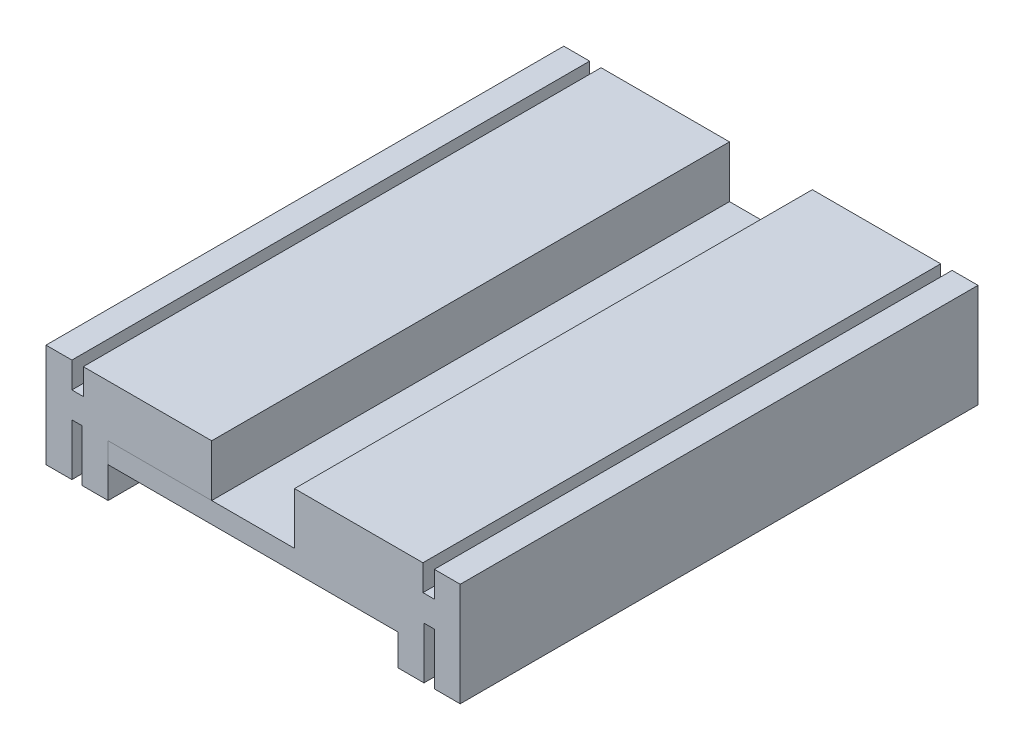
ISO-10303-21;
HEADER;
FILE_DESCRIPTION(('STEP AP214'),'2;1');
FILE_NAME('part.step','',(''),(''),'','','');
FILE_SCHEMA(('AUTOMOTIVE_DESIGN { 1 0 10303 214 1 1 1 1 }'));
ENDSEC;
DATA;
#1=APPLICATION_CONTEXT('core data for automotive mechanical design processes');
#2=APPLICATION_PROTOCOL_DEFINITION('international standard','automotive_design',2000,#1);
#3=PRODUCT_CONTEXT('',#1,'mechanical');
#4=PRODUCT('Part','Part','',(#3));
#5=PRODUCT_RELATED_PRODUCT_CATEGORY('part','',(#4));
#6=PRODUCT_DEFINITION_FORMATION('','',#4);
#7=PRODUCT_DEFINITION_CONTEXT('part definition',#1,'design');
#8=PRODUCT_DEFINITION('design','',#6,#7);
#9=PRODUCT_DEFINITION_SHAPE('','',#8);
#10=(LENGTH_UNIT() NAMED_UNIT(*) SI_UNIT(.MILLI.,.METRE.));
#11=(NAMED_UNIT(*) PLANE_ANGLE_UNIT() SI_UNIT($,.RADIAN.));
#12=(NAMED_UNIT(*) SI_UNIT($,.STERADIAN.) SOLID_ANGLE_UNIT());
#13=UNCERTAINTY_MEASURE_WITH_UNIT(LENGTH_MEASURE(1.E-05),#10,'distance_accuracy_value','');
#14=(GEOMETRIC_REPRESENTATION_CONTEXT(3) GLOBAL_UNCERTAINTY_ASSIGNED_CONTEXT((#13)) GLOBAL_UNIT_ASSIGNED_CONTEXT((#10,
#11,#12)) REPRESENTATION_CONTEXT('',''));
#15=CARTESIAN_POINT('',(0.,0.,0.));
#16=DIRECTION('',(0.,0.,1.));
#17=DIRECTION('',(1.,0.,0.));
#18=AXIS2_PLACEMENT_3D('',#15,#16,#17);
#19=CARTESIAN_POINT('',(28.,-20.,0.));
#20=DIRECTION('',(1.,0.,0.));
#21=DIRECTION('',(0.,0.,-1.));
#22=AXIS2_PLACEMENT_3D('',#19,#20,#21);
#23=PLANE('',#22);
#24=DIRECTION('',(0.,0.,1.));
#25=VECTOR('',#24,1.);
#26=CARTESIAN_POINT('',(28.,-14.,100.));
#27=LINE('',#26,#25);
#28=CARTESIAN_POINT('',(28.,-14.,0.));
#29=VERTEX_POINT('',#28);
#30=CARTESIAN_POINT('',(28.,-14.,100.));
#31=VERTEX_POINT('',#30);
#32=EDGE_CURVE('E64',#29,#31,#27,.T.);
#33=ORIENTED_EDGE('',*,*,#32,.F.);
#34=DIRECTION('',(0.,1.,0.));
#35=VECTOR('',#34,1.);
#36=CARTESIAN_POINT('',(28.,-20.,0.));
#37=LINE('',#36,#35);
#38=CARTESIAN_POINT('',(28.,-20.,0.));
#39=VERTEX_POINT('',#38);
#40=EDGE_CURVE('E164',#39,#29,#37,.T.);
#41=ORIENTED_EDGE('',*,*,#40,.F.);
#42=DIRECTION('',(0.,0.,-1.));
#43=VECTOR('',#42,1.);
#44=CARTESIAN_POINT('',(28.,-20.,0.));
#45=LINE('',#44,#43);
#46=CARTESIAN_POINT('',(28.,-20.,100.));
#47=VERTEX_POINT('',#46);
#48=EDGE_CURVE('E264',#47,#39,#45,.T.);
#49=ORIENTED_EDGE('',*,*,#48,.F.);
#50=DIRECTION('',(0.,1.,0.));
#51=VECTOR('',#50,1.);
#52=CARTESIAN_POINT('',(28.,-20.,100.));
#53=LINE('',#52,#51);
#54=EDGE_CURVE('E60',#47,#31,#53,.T.);
#55=ORIENTED_EDGE('',*,*,#54,.T.);
#56=EDGE_LOOP('',(#33,#41,#49,#55));
#57=FACE_BOUND('',#56,.T.);
#58=ADVANCED_FACE('F43',(#57),#23,.F.);
#59=CARTESIAN_POINT('',(-40.,0.,100.));
#60=DIRECTION('',(0.,1.,0.));
#61=DIRECTION('',(0.,0.,1.));
#62=AXIS2_PLACEMENT_3D('',#59,#60,#61);
#63=PLANE('',#62);
#64=DIRECTION('',(0.,0.,-1.));
#65=VECTOR('',#64,1.);
#66=CARTESIAN_POINT('',(8.,0.,100.));
#67=LINE('',#66,#65);
#68=CARTESIAN_POINT('',(8.,0.,100.));
#69=VERTEX_POINT('',#68);
#70=CARTESIAN_POINT('',(8.,0.,0.));
#71=VERTEX_POINT('',#70);
#72=EDGE_CURVE('E52',#69,#71,#67,.T.);
#73=ORIENTED_EDGE('',*,*,#72,.F.);
#74=DIRECTION('',(1.,0.,0.));
#75=VECTOR('',#74,1.);
#76=CARTESIAN_POINT('',(10.,0.,100.));
#77=LINE('',#76,#75);
#78=CARTESIAN_POINT('',(32.8,0.,100.));
#79=VERTEX_POINT('',#78);
#80=EDGE_CURVE('E184',#69,#79,#77,.T.);
#81=ORIENTED_EDGE('',*,*,#80,.T.);
#82=DIRECTION('',(0.,0.,1.));
#83=VECTOR('',#82,1.);
#84=CARTESIAN_POINT('',(32.8,0.,100.));
#85=LINE('',#84,#83);
#86=CARTESIAN_POINT('',(32.8,0.,0.));
#87=VERTEX_POINT('',#86);
#88=EDGE_CURVE('E207',#87,#79,#85,.T.);
#89=ORIENTED_EDGE('',*,*,#88,.F.);
#90=DIRECTION('',(1.,0.,0.));
#91=VECTOR('',#90,1.);
#92=CARTESIAN_POINT('',(-40.,0.,0.));
#93=LINE('',#92,#91);
#94=EDGE_CURVE('E47',#71,#87,#93,.T.);
#95=ORIENTED_EDGE('',*,*,#94,.F.);
#96=EDGE_LOOP('',(#73,#81,#89,#95));
#97=FACE_BOUND('',#96,.T.);
#98=ADVANCED_FACE('F304',(#97),#63,.T.);
#99=CARTESIAN_POINT('',(0.,0.,100.));
#100=DIRECTION('',(0.,0.,-1.));
#101=DIRECTION('',(-1.,0.,0.));
#102=AXIS2_PLACEMENT_3D('',#99,#100,#101);
#103=PLANE('',#102);
#104=ORIENTED_EDGE('',*,*,#80,.F.);
#105=DIRECTION('',(0.,1.,0.));
#106=VECTOR('',#105,1.);
#107=CARTESIAN_POINT('',(8.,-11.,100.));
#108=LINE('',#107,#106);
#109=CARTESIAN_POINT('',(8.,-10.,100.));
#110=VERTEX_POINT('',#109);
#111=EDGE_CURVE('E261',#110,#69,#108,.T.);
#112=ORIENTED_EDGE('',*,*,#111,.F.);
#113=DIRECTION('',(-1.,0.,0.));
#114=VECTOR('',#113,1.);
#115=CARTESIAN_POINT('',(-28.,-10.,100.));
#116=LINE('',#115,#114);
#117=CARTESIAN_POINT('',(-28.,-10.,100.));
#118=VERTEX_POINT('',#117);
#119=EDGE_CURVE('E175',#110,#118,#116,.T.);
#120=ORIENTED_EDGE('',*,*,#119,.T.);
#121=DIRECTION('',(0.,1.,0.));
#122=VECTOR('',#121,1.);
#123=CARTESIAN_POINT('',(-28.,-14.,100.));
#124=LINE('',#123,#122);
#125=CARTESIAN_POINT('',(-28.,-14.,100.));
#126=VERTEX_POINT('',#125);
#127=EDGE_CURVE('E181',#126,#118,#124,.T.);
#128=ORIENTED_EDGE('',*,*,#127,.F.);
#129=DIRECTION('',(-1.,0.,0.));
#130=VECTOR('',#129,1.);
#131=CARTESIAN_POINT('',(-28.,-14.,100.));
#132=LINE('',#131,#130);
#133=EDGE_CURVE('E171',#31,#126,#132,.T.);
#134=ORIENTED_EDGE('',*,*,#133,.F.);
#135=ORIENTED_EDGE('',*,*,#54,.F.);
#136=DIRECTION('',(-1.,0.,0.));
#137=VECTOR('',#136,1.);
#138=CARTESIAN_POINT('',(28.,-20.,100.));
#139=LINE('',#138,#137);
#140=CARTESIAN_POINT('',(33.,-20.,100.));
#141=VERTEX_POINT('',#140);
#142=EDGE_CURVE('E253',#141,#47,#139,.T.);
#143=ORIENTED_EDGE('',*,*,#142,.F.);
#144=DIRECTION('',(0.,1.,0.));
#145=VECTOR('',#144,1.);
#146=CARTESIAN_POINT('',(33.,-20.,100.));
#147=LINE('',#146,#145);
#148=CARTESIAN_POINT('',(33.,-10.,100.));
#149=VERTEX_POINT('',#148);
#150=EDGE_CURVE('E254',#141,#149,#147,.T.);
#151=ORIENTED_EDGE('',*,*,#150,.T.);
#152=DIRECTION('',(1.,0.,0.));
#153=VECTOR('',#152,1.);
#154=CARTESIAN_POINT('',(10.,-10.,100.));
#155=LINE('',#154,#153);
#156=CARTESIAN_POINT('',(35.,-10.,100.));
#157=VERTEX_POINT('',#156);
#158=EDGE_CURVE('E211',#149,#157,#155,.T.);
#159=ORIENTED_EDGE('',*,*,#158,.T.);
#160=DIRECTION('',(0.,1.,0.));
#161=VECTOR('',#160,1.);
#162=CARTESIAN_POINT('',(35.,-20.,100.));
#163=LINE('',#162,#161);
#164=CARTESIAN_POINT('',(35.,-20.,100.));
#165=VERTEX_POINT('',#164);
#166=EDGE_CURVE('E228',#165,#157,#163,.T.);
#167=ORIENTED_EDGE('',*,*,#166,.F.);
#168=DIRECTION('',(-1.,0.,0.));
#169=VECTOR('',#168,1.);
#170=CARTESIAN_POINT('',(35.,-20.,100.));
#171=LINE('',#170,#169);
#172=CARTESIAN_POINT('',(40.,-20.,100.));
#173=VERTEX_POINT('',#172);
#174=EDGE_CURVE('E231',#173,#165,#171,.T.);
#175=ORIENTED_EDGE('',*,*,#174,.F.);
#176=DIRECTION('',(0.,-1.,0.));
#177=VECTOR('',#176,1.);
#178=CARTESIAN_POINT('',(40.,0.,100.));
#179=LINE('',#178,#177);
#180=CARTESIAN_POINT('',(40.,0.,100.));
#181=VERTEX_POINT('',#180);
#182=EDGE_CURVE('E192',#181,#173,#179,.T.);
#183=ORIENTED_EDGE('',*,*,#182,.F.);
#184=CARTESIAN_POINT('',(35.,0.,100.));
#185=VERTEX_POINT('',#184);
#186=EDGE_CURVE('E193',#185,#181,#77,.T.);
#187=ORIENTED_EDGE('',*,*,#186,.F.);
#188=DIRECTION('',(0.,1.,0.));
#189=VECTOR('',#188,1.);
#190=CARTESIAN_POINT('',(35.,-5.,100.));
#191=LINE('',#190,#189);
#192=CARTESIAN_POINT('',(35.,-5.,100.));
#193=VERTEX_POINT('',#192);
#194=EDGE_CURVE('E212',#193,#185,#191,.T.);
#195=ORIENTED_EDGE('',*,*,#194,.F.);
#196=DIRECTION('',(1.,0.,0.));
#197=VECTOR('',#196,1.);
#198=CARTESIAN_POINT('',(35.,-5.,100.));
#199=LINE('',#198,#197);
#200=CARTESIAN_POINT('',(32.8,-5.,100.));
#201=VERTEX_POINT('',#200);
#202=EDGE_CURVE('E217',#201,#193,#199,.T.);
#203=ORIENTED_EDGE('',*,*,#202,.F.);
#204=DIRECTION('',(0.,1.,0.));
#205=VECTOR('',#204,1.);
#206=CARTESIAN_POINT('',(32.8,-5.,100.));
#207=LINE('',#206,#205);
#208=EDGE_CURVE('E208',#201,#79,#207,.T.);
#209=ORIENTED_EDGE('',*,*,#208,.T.);
#210=EDGE_LOOP('',(#104,#112,#120,#128,#134,#135,#143,#151,#159,#167,#175,#183,#187,#195,#203,#209));
#211=FACE_BOUND('',#210,.T.);
#212=ADVANCED_FACE('F289',(#211),#103,.F.);
#213=CARTESIAN_POINT('',(0.,0.,0.));
#214=DIRECTION('',(0.,0.,-1.));
#215=DIRECTION('',(-1.,0.,0.));
#216=AXIS2_PLACEMENT_3D('',#213,#214,#215);
#217=PLANE('',#216);
#218=DIRECTION('',(0.,-1.,0.));
#219=VECTOR('',#218,1.);
#220=CARTESIAN_POINT('',(8.,0.,0.));
#221=LINE('',#220,#219);
#222=CARTESIAN_POINT('',(8.,-10.,0.));
#223=VERTEX_POINT('',#222);
#224=EDGE_CURVE('E12',#71,#223,#221,.T.);
#225=ORIENTED_EDGE('',*,*,#224,.F.);
#226=ORIENTED_EDGE('',*,*,#94,.T.);
#227=DIRECTION('',(0.,1.,0.));
#228=VECTOR('',#227,1.);
#229=CARTESIAN_POINT('',(32.8,-5.,0.));
#230=LINE('',#229,#228);
#231=CARTESIAN_POINT('',(32.8,-5.,0.));
#232=VERTEX_POINT('',#231);
#233=EDGE_CURVE('E203',#232,#87,#230,.T.);
#234=ORIENTED_EDGE('',*,*,#233,.F.);
#235=DIRECTION('',(-1.,0.,0.));
#236=VECTOR('',#235,1.);
#237=CARTESIAN_POINT('',(32.8,-5.,0.));
#238=LINE('',#237,#236);
#239=CARTESIAN_POINT('',(35.,-5.,0.));
#240=VERTEX_POINT('',#239);
#241=EDGE_CURVE('E224',#240,#232,#238,.T.);
#242=ORIENTED_EDGE('',*,*,#241,.F.);
#243=DIRECTION('',(0.,1.,0.));
#244=VECTOR('',#243,1.);
#245=CARTESIAN_POINT('',(35.,-5.,0.));
#246=LINE('',#245,#244);
#247=CARTESIAN_POINT('',(35.,0.,0.));
#248=VERTEX_POINT('',#247);
#249=EDGE_CURVE('E200',#240,#248,#246,.T.);
#250=ORIENTED_EDGE('',*,*,#249,.T.);
#251=CARTESIAN_POINT('',(40.,0.,0.));
#252=VERTEX_POINT('',#251);
#253=EDGE_CURVE('E197',#248,#252,#93,.T.);
#254=ORIENTED_EDGE('',*,*,#253,.T.);
#255=DIRECTION('',(0.,-1.,0.));
#256=VECTOR('',#255,1.);
#257=CARTESIAN_POINT('',(40.,0.,0.));
#258=LINE('',#257,#256);
#259=CARTESIAN_POINT('',(40.,-20.,0.));
#260=VERTEX_POINT('',#259);
#261=EDGE_CURVE('E194',#252,#260,#258,.T.);
#262=ORIENTED_EDGE('',*,*,#261,.T.);
#263=DIRECTION('',(1.,0.,0.));
#264=VECTOR('',#263,1.);
#265=CARTESIAN_POINT('',(40.,-20.,0.));
#266=LINE('',#265,#264);
#267=CARTESIAN_POINT('',(35.,-20.,0.));
#268=VERTEX_POINT('',#267);
#269=EDGE_CURVE('E239',#268,#260,#266,.T.);
#270=ORIENTED_EDGE('',*,*,#269,.F.);
#271=DIRECTION('',(0.,1.,0.));
#272=VECTOR('',#271,1.);
#273=CARTESIAN_POINT('',(35.,-20.,0.));
#274=LINE('',#273,#272);
#275=CARTESIAN_POINT('',(35.,-10.,0.));
#276=VERTEX_POINT('',#275);
#277=EDGE_CURVE('E196',#268,#276,#274,.T.);
#278=ORIENTED_EDGE('',*,*,#277,.T.);
#279=DIRECTION('',(1.,0.,0.));
#280=VECTOR('',#279,1.);
#281=CARTESIAN_POINT('',(-10.,-10.,0.));
#282=LINE('',#281,#280);
#283=CARTESIAN_POINT('',(33.,-10.,0.));
#284=VERTEX_POINT('',#283);
#285=EDGE_CURVE('E249',#284,#276,#282,.T.);
#286=ORIENTED_EDGE('',*,*,#285,.F.);
#287=DIRECTION('',(0.,1.,0.));
#288=VECTOR('',#287,1.);
#289=CARTESIAN_POINT('',(33.,-20.,0.));
#290=LINE('',#289,#288);
#291=CARTESIAN_POINT('',(33.,-20.,0.));
#292=VERTEX_POINT('',#291);
#293=EDGE_CURVE('E250',#292,#284,#290,.T.);
#294=ORIENTED_EDGE('',*,*,#293,.F.);
#295=DIRECTION('',(1.,0.,0.));
#296=VECTOR('',#295,1.);
#297=CARTESIAN_POINT('',(33.,-20.,0.));
#298=LINE('',#297,#296);
#299=EDGE_CURVE('E262',#39,#292,#298,.T.);
#300=ORIENTED_EDGE('',*,*,#299,.F.);
#301=ORIENTED_EDGE('',*,*,#40,.T.);
#302=DIRECTION('',(1.,0.,0.));
#303=VECTOR('',#302,1.);
#304=CARTESIAN_POINT('',(28.,-14.,0.));
#305=LINE('',#304,#303);
#306=CARTESIAN_POINT('',(-28.,-14.,0.));
#307=VERTEX_POINT('',#306);
#308=EDGE_CURVE('E156',#307,#29,#305,.T.);
#309=ORIENTED_EDGE('',*,*,#308,.F.);
#310=DIRECTION('',(0.,1.,0.));
#311=VECTOR('',#310,1.);
#312=CARTESIAN_POINT('',(-28.,-14.,0.));
#313=LINE('',#312,#311);
#314=CARTESIAN_POINT('',(-28.,-10.,0.));
#315=VERTEX_POINT('',#314);
#316=EDGE_CURVE('E161',#307,#315,#313,.T.);
#317=ORIENTED_EDGE('',*,*,#316,.T.);
#318=DIRECTION('',(1.,0.,0.));
#319=VECTOR('',#318,1.);
#320=CARTESIAN_POINT('',(28.,-10.,0.));
#321=LINE('',#320,#319);
#322=EDGE_CURVE('E467',#315,#223,#321,.T.);
#323=ORIENTED_EDGE('',*,*,#322,.T.);
#324=EDGE_LOOP('',(#225,#226,#234,#242,#250,#254,#262,#270,#278,#286,#294,#300,#301,#309,#317,#323));
#325=FACE_BOUND('',#324,.T.);
#326=ADVANCED_FACE('F45',(#325),#217,.T.);
#327=CARTESIAN_POINT('',(-10.,-10.,100.));
#328=DIRECTION('',(0.,1.,0.));
#329=DIRECTION('',(0.,0.,1.));
#330=AXIS2_PLACEMENT_3D('',#327,#328,#329);
#331=PLANE('',#330);
#332=DIRECTION('',(0.,0.,1.));
#333=VECTOR('',#332,1.);
#334=CARTESIAN_POINT('',(33.,-10.,100.));
#335=LINE('',#334,#333);
#336=EDGE_CURVE('E247',#284,#149,#335,.T.);
#337=ORIENTED_EDGE('',*,*,#336,.F.);
#338=ORIENTED_EDGE('',*,*,#285,.T.);
#339=DIRECTION('',(0.,0.,-1.));
#340=VECTOR('',#339,1.);
#341=CARTESIAN_POINT('',(35.,-10.,0.));
#342=LINE('',#341,#340);
#343=EDGE_CURVE('E220',#157,#276,#342,.T.);
#344=ORIENTED_EDGE('',*,*,#343,.F.);
#345=ORIENTED_EDGE('',*,*,#158,.F.);
#346=EDGE_LOOP('',(#337,#338,#344,#345));
#347=FACE_BOUND('',#346,.T.);
#348=ADVANCED_FACE('F342',(#347),#331,.F.);
#349=DIRECTION('',(0.,0.,-1.));
#350=VECTOR('',#349,1.);
#351=CARTESIAN_POINT('',(35.,0.,0.));
#352=LINE('',#351,#350);
#353=EDGE_CURVE('E199',#185,#248,#352,.T.);
#354=ORIENTED_EDGE('',*,*,#353,.F.);
#355=ORIENTED_EDGE('',*,*,#186,.T.);
#356=DIRECTION('',(0.,0.,-1.));
#357=VECTOR('',#356,1.);
#358=CARTESIAN_POINT('',(40.,0.,100.));
#359=LINE('',#358,#357);
#360=EDGE_CURVE('E189',#181,#252,#359,.T.);
#361=ORIENTED_EDGE('',*,*,#360,.T.);
#362=ORIENTED_EDGE('',*,*,#253,.F.);
#363=EDGE_LOOP('',(#354,#355,#361,#362));
#364=FACE_BOUND('',#363,.T.);
#365=ADVANCED_FACE('F278',(#364),#63,.T.);
#366=CARTESIAN_POINT('',(40.,0.,100.));
#367=DIRECTION('',(1.,0.,0.));
#368=DIRECTION('',(0.,0.,-1.));
#369=AXIS2_PLACEMENT_3D('',#366,#367,#368);
#370=PLANE('',#369);
#371=ORIENTED_EDGE('',*,*,#261,.F.);
#372=ORIENTED_EDGE('',*,*,#360,.F.);
#373=ORIENTED_EDGE('',*,*,#182,.T.);
#374=DIRECTION('',(0.,0.,1.));
#375=VECTOR('',#374,1.);
#376=CARTESIAN_POINT('',(40.,-20.,100.));
#377=LINE('',#376,#375);
#378=EDGE_CURVE('E236',#260,#173,#377,.T.);
#379=ORIENTED_EDGE('',*,*,#378,.F.);
#380=EDGE_LOOP('',(#371,#372,#373,#379));
#381=FACE_BOUND('',#380,.T.);
#382=ADVANCED_FACE('F285',(#381),#370,.T.);
#383=CARTESIAN_POINT('',(35.,-5.,0.));
#384=DIRECTION('',(1.,0.,0.));
#385=DIRECTION('',(0.,0.,-1.));
#386=AXIS2_PLACEMENT_3D('',#383,#384,#385);
#387=PLANE('',#386);
#388=ORIENTED_EDGE('',*,*,#353,.T.);
#389=ORIENTED_EDGE('',*,*,#249,.F.);
#390=DIRECTION('',(0.,0.,-1.));
#391=VECTOR('',#390,1.);
#392=CARTESIAN_POINT('',(35.,-5.,0.));
#393=LINE('',#392,#391);
#394=EDGE_CURVE('E206',#193,#240,#393,.T.);
#395=ORIENTED_EDGE('',*,*,#394,.F.);
#396=ORIENTED_EDGE('',*,*,#194,.T.);
#397=EDGE_LOOP('',(#388,#389,#395,#396));
#398=FACE_BOUND('',#397,.T.);
#399=ADVANCED_FACE('F311',(#398),#387,.F.);
#400=CARTESIAN_POINT('',(32.8,-5.,100.));
#401=DIRECTION('',(-1.,0.,0.));
#402=DIRECTION('',(0.,0.,1.));
#403=AXIS2_PLACEMENT_3D('',#400,#401,#402);
#404=PLANE('',#403);
#405=ORIENTED_EDGE('',*,*,#88,.T.);
#406=ORIENTED_EDGE('',*,*,#208,.F.);
#407=DIRECTION('',(0.,0.,1.));
#408=VECTOR('',#407,1.);
#409=CARTESIAN_POINT('',(32.8,-5.,100.));
#410=LINE('',#409,#408);
#411=EDGE_CURVE('E221',#232,#201,#410,.T.);
#412=ORIENTED_EDGE('',*,*,#411,.F.);
#413=ORIENTED_EDGE('',*,*,#233,.T.);
#414=EDGE_LOOP('',(#405,#406,#412,#413));
#415=FACE_BOUND('',#414,.T.);
#416=ADVANCED_FACE('F303',(#415),#404,.F.);
#417=CARTESIAN_POINT('',(0.,-5.,0.));
#418=DIRECTION('',(0.,-1.,0.));
#419=DIRECTION('',(0.,0.,-1.));
#420=AXIS2_PLACEMENT_3D('',#417,#418,#419);
#421=PLANE('',#420);
#422=ORIENTED_EDGE('',*,*,#394,.T.);
#423=ORIENTED_EDGE('',*,*,#241,.T.);
#424=ORIENTED_EDGE('',*,*,#411,.T.);
#425=ORIENTED_EDGE('',*,*,#202,.T.);
#426=EDGE_LOOP('',(#422,#423,#424,#425));
#427=FACE_BOUND('',#426,.T.);
#428=ADVANCED_FACE('F309',(#427),#421,.F.);
#429=CARTESIAN_POINT('',(35.,-20.,0.));
#430=DIRECTION('',(1.,0.,0.));
#431=DIRECTION('',(0.,0.,-1.));
#432=AXIS2_PLACEMENT_3D('',#429,#430,#431);
#433=PLANE('',#432);
#434=ORIENTED_EDGE('',*,*,#343,.T.);
#435=ORIENTED_EDGE('',*,*,#277,.F.);
#436=DIRECTION('',(0.,0.,-1.));
#437=VECTOR('',#436,1.);
#438=CARTESIAN_POINT('',(35.,-20.,0.));
#439=LINE('',#438,#437);
#440=EDGE_CURVE('E242',#165,#268,#439,.T.);
#441=ORIENTED_EDGE('',*,*,#440,.F.);
#442=ORIENTED_EDGE('',*,*,#166,.T.);
#443=EDGE_LOOP('',(#434,#435,#441,#442));
#444=FACE_BOUND('',#443,.T.);
#445=ADVANCED_FACE('F386',(#444),#433,.F.);
#446=CARTESIAN_POINT('',(0.,-20.,0.));
#447=DIRECTION('',(0.,1.,0.));
#448=DIRECTION('',(0.,0.,1.));
#449=AXIS2_PLACEMENT_3D('',#446,#447,#448);
#450=PLANE('',#449);
#451=ORIENTED_EDGE('',*,*,#174,.T.);
#452=ORIENTED_EDGE('',*,*,#440,.T.);
#453=ORIENTED_EDGE('',*,*,#269,.T.);
#454=ORIENTED_EDGE('',*,*,#378,.T.);
#455=EDGE_LOOP('',(#451,#452,#453,#454));
#456=FACE_BOUND('',#455,.T.);
#457=ADVANCED_FACE('F292',(#456),#450,.F.);
#458=CARTESIAN_POINT('',(33.,-20.,100.));
#459=DIRECTION('',(-1.,0.,0.));
#460=DIRECTION('',(0.,0.,1.));
#461=AXIS2_PLACEMENT_3D('',#458,#459,#460);
#462=PLANE('',#461);
#463=ORIENTED_EDGE('',*,*,#336,.T.);
#464=ORIENTED_EDGE('',*,*,#150,.F.);
#465=DIRECTION('',(0.,0.,1.));
#466=VECTOR('',#465,1.);
#467=CARTESIAN_POINT('',(33.,-20.,100.));
#468=LINE('',#467,#466);
#469=EDGE_CURVE('E259',#292,#141,#468,.T.);
#470=ORIENTED_EDGE('',*,*,#469,.F.);
#471=ORIENTED_EDGE('',*,*,#293,.T.);
#472=EDGE_LOOP('',(#463,#464,#470,#471));
#473=FACE_BOUND('',#472,.T.);
#474=ADVANCED_FACE('F329',(#473),#462,.F.);
#475=CARTESIAN_POINT('',(0.,-20.,0.));
#476=DIRECTION('',(0.,1.,0.));
#477=DIRECTION('',(0.,0.,1.));
#478=AXIS2_PLACEMENT_3D('',#475,#476,#477);
#479=PLANE('',#478);
#480=ORIENTED_EDGE('',*,*,#142,.T.);
#481=ORIENTED_EDGE('',*,*,#48,.T.);
#482=ORIENTED_EDGE('',*,*,#299,.T.);
#483=ORIENTED_EDGE('',*,*,#469,.T.);
#484=EDGE_LOOP('',(#480,#481,#482,#483));
#485=FACE_BOUND('',#484,.T.);
#486=ADVANCED_FACE('F332',(#485),#479,.F.);
#487=CARTESIAN_POINT('',(8.,-11.,100.));
#488=DIRECTION('',(1.,0.,0.));
#489=DIRECTION('',(0.,0.,-1.));
#490=AXIS2_PLACEMENT_3D('',#487,#488,#489);
#491=PLANE('',#490);
#492=ORIENTED_EDGE('',*,*,#111,.T.);
#493=ORIENTED_EDGE('',*,*,#72,.T.);
#494=ORIENTED_EDGE('',*,*,#224,.T.);
#495=DIRECTION('',(0.,0.,-1.));
#496=VECTOR('',#495,1.);
#497=CARTESIAN_POINT('',(8.,-10.,100.));
#498=LINE('',#497,#496);
#499=EDGE_CURVE('E180',#110,#223,#498,.T.);
#500=ORIENTED_EDGE('',*,*,#499,.F.);
#501=EDGE_LOOP('',(#492,#493,#494,#500));
#502=FACE_BOUND('',#501,.T.);
#503=ADVANCED_FACE('F336',(#502),#491,.F.);
#504=CARTESIAN_POINT('',(0.,-10.,0.));
#505=DIRECTION('',(0.,1.,0.));
#506=DIRECTION('',(0.,0.,1.));
#507=AXIS2_PLACEMENT_3D('',#504,#505,#506);
#508=PLANE('',#507);
#509=ORIENTED_EDGE('',*,*,#499,.T.);
#510=ORIENTED_EDGE('',*,*,#322,.F.);
#511=DIRECTION('',(0.,0.,-1.));
#512=VECTOR('',#511,1.);
#513=CARTESIAN_POINT('',(-28.,-10.,0.));
#514=LINE('',#513,#512);
#515=EDGE_CURVE('E179',#118,#315,#514,.T.);
#516=ORIENTED_EDGE('',*,*,#515,.F.);
#517=ORIENTED_EDGE('',*,*,#119,.F.);
#518=EDGE_LOOP('',(#509,#510,#516,#517));
#519=FACE_BOUND('',#518,.T.);
#520=ADVANCED_FACE('F339',(#519),#508,.T.);
#521=CARTESIAN_POINT('',(-28.,-14.,0.));
#522=DIRECTION('',(1.,0.,0.));
#523=DIRECTION('',(0.,0.,-1.));
#524=AXIS2_PLACEMENT_3D('',#521,#522,#523);
#525=PLANE('',#524);
#526=ORIENTED_EDGE('',*,*,#515,.T.);
#527=ORIENTED_EDGE('',*,*,#316,.F.);
#528=DIRECTION('',(0.,0.,-1.));
#529=VECTOR('',#528,1.);
#530=CARTESIAN_POINT('',(-28.,-14.,0.));
#531=LINE('',#530,#529);
#532=EDGE_CURVE('E166',#126,#307,#531,.T.);
#533=ORIENTED_EDGE('',*,*,#532,.F.);
#534=ORIENTED_EDGE('',*,*,#127,.T.);
#535=EDGE_LOOP('',(#526,#527,#533,#534));
#536=FACE_BOUND('',#535,.T.);
#537=ADVANCED_FACE('F177',(#536),#525,.F.);
#538=CARTESIAN_POINT('',(0.,-14.,0.));
#539=DIRECTION('',(0.,1.,0.));
#540=DIRECTION('',(0.,0.,1.));
#541=AXIS2_PLACEMENT_3D('',#538,#539,#540);
#542=PLANE('',#541);
#543=ORIENTED_EDGE('',*,*,#532,.T.);
#544=ORIENTED_EDGE('',*,*,#308,.T.);
#545=ORIENTED_EDGE('',*,*,#32,.T.);
#546=ORIENTED_EDGE('',*,*,#133,.T.);
#547=EDGE_LOOP('',(#543,#544,#545,#546));
#548=FACE_BOUND('',#547,.T.);
#549=ADVANCED_FACE('F169',(#548),#542,.F.);
#550=CLOSED_SHELL('',(#58,#98,#212,#326,#348,#365,#382,#399,#416,#428,#445,#457,#474,#486,#503,
#520,#537,#549));
#551=MANIFOLD_SOLID_BREP('B2',#550);
#552=CARTESIAN_POINT('',(-32.8,-5.,100.));
#553=DIRECTION('',(1.,0.,0.));
#554=DIRECTION('',(0.,0.,-1.));
#555=AXIS2_PLACEMENT_3D('',#552,#553,#554);
#556=PLANE('',#555);
#557=DIRECTION('',(0.,0.,-1.));
#558=VECTOR('',#557,1.);
#559=CARTESIAN_POINT('',(-32.8,0.,100.));
#560=LINE('',#559,#558);
#561=CARTESIAN_POINT('',(-32.8,0.,100.));
#562=VERTEX_POINT('',#561);
#563=CARTESIAN_POINT('',(-32.8,0.,0.));
#564=VERTEX_POINT('',#563);
#565=EDGE_CURVE('E681',#562,#564,#560,.T.);
#566=ORIENTED_EDGE('',*,*,#565,.T.);
#567=DIRECTION('',(0.,1.,0.));
#568=VECTOR('',#567,1.);
#569=CARTESIAN_POINT('',(-32.8,-5.,0.));
#570=LINE('',#569,#568);
#571=CARTESIAN_POINT('',(-32.8,-5.,0.));
#572=VERTEX_POINT('',#571);
#573=EDGE_CURVE('E646',#572,#564,#570,.T.);
#574=ORIENTED_EDGE('',*,*,#573,.F.);
#575=DIRECTION('',(0.,0.,-1.));
#576=VECTOR('',#575,1.);
#577=CARTESIAN_POINT('',(-32.8,-5.,100.));
#578=LINE('',#577,#576);
#579=CARTESIAN_POINT('',(-32.8,-5.,100.));
#580=VERTEX_POINT('',#579);
#581=EDGE_CURVE('E677',#580,#572,#578,.T.);
#582=ORIENTED_EDGE('',*,*,#581,.F.);
#583=DIRECTION('',(0.,1.,0.));
#584=VECTOR('',#583,1.);
#585=CARTESIAN_POINT('',(-32.8,-5.,100.));
#586=LINE('',#585,#584);
#587=EDGE_CURVE('E651',#580,#562,#586,.T.);
#588=ORIENTED_EDGE('',*,*,#587,.T.);
#589=EDGE_LOOP('',(#566,#574,#582,#588));
#590=FACE_BOUND('',#589,.T.);
#591=ADVANCED_FACE('F527',(#590),#556,.F.);
#592=CARTESIAN_POINT('',(0.,-5.,0.));
#593=DIRECTION('',(0.,1.,0.));
#594=DIRECTION('',(0.,0.,1.));
#595=AXIS2_PLACEMENT_3D('',#592,#593,#594);
#596=PLANE('',#595);
#597=DIRECTION('',(-1.,0.,0.));
#598=VECTOR('',#597,1.);
#599=CARTESIAN_POINT('',(-32.8,-5.,0.));
#600=LINE('',#599,#598);
#601=CARTESIAN_POINT('',(-35.,-5.,0.));
#602=VERTEX_POINT('',#601);
#603=EDGE_CURVE('E683',#572,#602,#600,.T.);
#604=ORIENTED_EDGE('',*,*,#603,.T.);
#605=DIRECTION('',(0.,0.,1.));
#606=VECTOR('',#605,1.);
#607=CARTESIAN_POINT('',(-35.,-5.,0.));
#608=LINE('',#607,#606);
#609=CARTESIAN_POINT('',(-35.,-5.,100.));
#610=VERTEX_POINT('',#609);
#611=EDGE_CURVE('E690',#602,#610,#608,.T.);
#612=ORIENTED_EDGE('',*,*,#611,.T.);
#613=DIRECTION('',(1.,0.,0.));
#614=VECTOR('',#613,1.);
#615=CARTESIAN_POINT('',(-35.,-5.,100.));
#616=LINE('',#615,#614);
#617=EDGE_CURVE('E688',#610,#580,#616,.T.);
#618=ORIENTED_EDGE('',*,*,#617,.T.);
#619=ORIENTED_EDGE('',*,*,#581,.T.);
#620=EDGE_LOOP('',(#604,#612,#618,#619));
#621=FACE_BOUND('',#620,.T.);
#622=ADVANCED_FACE('F779',(#621),#596,.T.);
#623=CARTESIAN_POINT('',(-35.,-5.,0.));
#624=DIRECTION('',(-1.,0.,0.));
#625=DIRECTION('',(0.,0.,1.));
#626=AXIS2_PLACEMENT_3D('',#623,#624,#625);
#627=PLANE('',#626);
#628=DIRECTION('',(0.,0.,1.));
#629=VECTOR('',#628,1.);
#630=CARTESIAN_POINT('',(-35.,0.,0.));
#631=LINE('',#630,#629);
#632=CARTESIAN_POINT('',(-35.,0.,0.));
#633=VERTEX_POINT('',#632);
#634=CARTESIAN_POINT('',(-35.,0.,100.));
#635=VERTEX_POINT('',#634);
#636=EDGE_CURVE('E684',#633,#635,#631,.T.);
#637=ORIENTED_EDGE('',*,*,#636,.T.);
#638=DIRECTION('',(0.,1.,0.));
#639=VECTOR('',#638,1.);
#640=CARTESIAN_POINT('',(-35.,-5.,100.));
#641=LINE('',#640,#639);
#642=EDGE_CURVE('E676',#610,#635,#641,.T.);
#643=ORIENTED_EDGE('',*,*,#642,.F.);
#644=ORIENTED_EDGE('',*,*,#611,.F.);
#645=DIRECTION('',(0.,1.,0.));
#646=VECTOR('',#645,1.);
#647=CARTESIAN_POINT('',(-35.,-5.,0.));
#648=LINE('',#647,#646);
#649=EDGE_CURVE('E674',#602,#633,#648,.T.);
#650=ORIENTED_EDGE('',*,*,#649,.T.);
#651=EDGE_LOOP('',(#637,#643,#644,#650));
#652=FACE_BOUND('',#651,.T.);
#653=ADVANCED_FACE('F776',(#652),#627,.F.);
#654=CARTESIAN_POINT('',(-40.,0.,100.));
#655=DIRECTION('',(0.,1.,0.));
#656=DIRECTION('',(0.,0.,1.));
#657=AXIS2_PLACEMENT_3D('',#654,#655,#656);
#658=PLANE('',#657);
#659=ORIENTED_EDGE('',*,*,#636,.F.);
#660=DIRECTION('',(1.,0.,0.));
#661=VECTOR('',#660,1.);
#662=CARTESIAN_POINT('',(-40.,0.,0.));
#663=LINE('',#662,#661);
#664=CARTESIAN_POINT('',(-40.,0.,0.));
#665=VERTEX_POINT('',#664);
#666=EDGE_CURVE('E647',#665,#633,#663,.T.);
#667=ORIENTED_EDGE('',*,*,#666,.F.);
#668=DIRECTION('',(0.,0.,-1.));
#669=VECTOR('',#668,1.);
#670=CARTESIAN_POINT('',(-40.,0.,100.));
#671=LINE('',#670,#669);
#672=CARTESIAN_POINT('',(-40.,0.,100.));
#673=VERTEX_POINT('',#672);
#674=EDGE_CURVE('E535',#673,#665,#671,.T.);
#675=ORIENTED_EDGE('',*,*,#674,.F.);
#676=DIRECTION('',(1.,0.,0.));
#677=VECTOR('',#676,1.);
#678=CARTESIAN_POINT('',(10.,0.,100.));
#679=LINE('',#678,#677);
#680=EDGE_CURVE('E665',#673,#635,#679,.T.);
#681=ORIENTED_EDGE('',*,*,#680,.T.);
#682=EDGE_LOOP('',(#659,#667,#675,#681));
#683=FACE_BOUND('',#682,.T.);
#684=ADVANCED_FACE('F529',(#683),#658,.T.);
#685=CARTESIAN_POINT('',(-40.,-10.,100.));
#686=DIRECTION('',(-1.,0.,0.));
#687=DIRECTION('',(0.,0.,1.));
#688=AXIS2_PLACEMENT_3D('',#685,#686,#687);
#689=PLANE('',#688);
#690=DIRECTION('',(0.,1.,0.));
#691=VECTOR('',#690,1.);
#692=CARTESIAN_POINT('',(-40.,-10.,0.));
#693=LINE('',#692,#691);
#694=CARTESIAN_POINT('',(-40.,-20.,0.));
#695=VERTEX_POINT('',#694);
#696=EDGE_CURVE('E650',#695,#665,#693,.T.);
#697=ORIENTED_EDGE('',*,*,#696,.F.);
#698=DIRECTION('',(0.,0.,-1.));
#699=VECTOR('',#698,1.);
#700=CARTESIAN_POINT('',(-40.,-20.,100.));
#701=LINE('',#700,#699);
#702=CARTESIAN_POINT('',(-40.,-20.,100.));
#703=VERTEX_POINT('',#702);
#704=EDGE_CURVE('E709',#703,#695,#701,.T.);
#705=ORIENTED_EDGE('',*,*,#704,.F.);
#706=DIRECTION('',(0.,1.,0.));
#707=VECTOR('',#706,1.);
#708=CARTESIAN_POINT('',(-40.,-10.,100.));
#709=LINE('',#708,#707);
#710=EDGE_CURVE('E655',#703,#673,#709,.T.);
#711=ORIENTED_EDGE('',*,*,#710,.T.);
#712=ORIENTED_EDGE('',*,*,#674,.T.);
#713=EDGE_LOOP('',(#697,#705,#711,#712));
#714=FACE_BOUND('',#713,.T.);
#715=ADVANCED_FACE('F769',(#714),#689,.T.);
#716=CARTESIAN_POINT('',(0.,-20.,0.));
#717=DIRECTION('',(0.,-1.,0.));
#718=DIRECTION('',(0.,0.,-1.));
#719=AXIS2_PLACEMENT_3D('',#716,#717,#718);
#720=PLANE('',#719);
#721=DIRECTION('',(-1.,0.,0.));
#722=VECTOR('',#721,1.);
#723=CARTESIAN_POINT('',(-35.,-20.,100.));
#724=LINE('',#723,#722);
#725=CARTESIAN_POINT('',(-35.,-20.,100.));
#726=VERTEX_POINT('',#725);
#727=EDGE_CURVE('E704',#726,#703,#724,.T.);
#728=ORIENTED_EDGE('',*,*,#727,.T.);
#729=ORIENTED_EDGE('',*,*,#704,.T.);
#730=DIRECTION('',(1.,0.,0.));
#731=VECTOR('',#730,1.);
#732=CARTESIAN_POINT('',(-40.,-20.,0.));
#733=LINE('',#732,#731);
#734=CARTESIAN_POINT('',(-35.,-20.,0.));
#735=VERTEX_POINT('',#734);
#736=EDGE_CURVE('E707',#695,#735,#733,.T.);
#737=ORIENTED_EDGE('',*,*,#736,.T.);
#738=DIRECTION('',(0.,0.,1.));
#739=VECTOR('',#738,1.);
#740=CARTESIAN_POINT('',(-35.,-20.,0.));
#741=LINE('',#740,#739);
#742=EDGE_CURVE('E700',#735,#726,#741,.T.);
#743=ORIENTED_EDGE('',*,*,#742,.T.);
#744=EDGE_LOOP('',(#728,#729,#737,#743));
#745=FACE_BOUND('',#744,.T.);
#746=ADVANCED_FACE('F767',(#745),#720,.T.);
#747=CARTESIAN_POINT('',(-35.,-20.,0.));
#748=DIRECTION('',(-1.,0.,0.));
#749=DIRECTION('',(0.,0.,1.));
#750=AXIS2_PLACEMENT_3D('',#747,#748,#749);
#751=PLANE('',#750);
#752=DIRECTION('',(0.,0.,1.));
#753=VECTOR('',#752,1.);
#754=CARTESIAN_POINT('',(-35.,-10.,0.));
#755=LINE('',#754,#753);
#756=CARTESIAN_POINT('',(-35.,-10.,0.));
#757=VERTEX_POINT('',#756);
#758=CARTESIAN_POINT('',(-35.,-10.,100.));
#759=VERTEX_POINT('',#758);
#760=EDGE_CURVE('E701',#757,#759,#755,.T.);
#761=ORIENTED_EDGE('',*,*,#760,.T.);
#762=DIRECTION('',(0.,1.,0.));
#763=VECTOR('',#762,1.);
#764=CARTESIAN_POINT('',(-35.,-20.,100.));
#765=LINE('',#764,#763);
#766=EDGE_CURVE('E697',#726,#759,#765,.T.);
#767=ORIENTED_EDGE('',*,*,#766,.F.);
#768=ORIENTED_EDGE('',*,*,#742,.F.);
#769=DIRECTION('',(0.,1.,0.));
#770=VECTOR('',#769,1.);
#771=CARTESIAN_POINT('',(-35.,-20.,0.));
#772=LINE('',#771,#770);
#773=EDGE_CURVE('E686',#735,#757,#772,.T.);
#774=ORIENTED_EDGE('',*,*,#773,.T.);
#775=EDGE_LOOP('',(#761,#767,#768,#774));
#776=FACE_BOUND('',#775,.T.);
#777=ADVANCED_FACE('F763',(#776),#751,.F.);
#778=CARTESIAN_POINT('',(-10.,-10.,100.));
#779=DIRECTION('',(0.,1.,0.));
#780=DIRECTION('',(0.,0.,1.));
#781=AXIS2_PLACEMENT_3D('',#778,#779,#780);
#782=PLANE('',#781);
#783=DIRECTION('',(0.,0.,-1.));
#784=VECTOR('',#783,1.);
#785=CARTESIAN_POINT('',(-33.,-10.,100.));
#786=LINE('',#785,#784);
#787=CARTESIAN_POINT('',(-33.,-10.,100.));
#788=VERTEX_POINT('',#787);
#789=CARTESIAN_POINT('',(-33.,-10.,0.));
#790=VERTEX_POINT('',#789);
#791=EDGE_CURVE('E729',#788,#790,#786,.T.);
#792=ORIENTED_EDGE('',*,*,#791,.F.);
#793=DIRECTION('',(1.,0.,0.));
#794=VECTOR('',#793,1.);
#795=CARTESIAN_POINT('',(10.,-10.,100.));
#796=LINE('',#795,#794);
#797=EDGE_CURVE('E670',#759,#788,#796,.T.);
#798=ORIENTED_EDGE('',*,*,#797,.F.);
#799=ORIENTED_EDGE('',*,*,#760,.F.);
#800=DIRECTION('',(1.,0.,0.));
#801=VECTOR('',#800,1.);
#802=CARTESIAN_POINT('',(-10.,-10.,0.));
#803=LINE('',#802,#801);
#804=EDGE_CURVE('E660',#757,#790,#803,.T.);
#805=ORIENTED_EDGE('',*,*,#804,.T.);
#806=EDGE_LOOP('',(#792,#798,#799,#805));
#807=FACE_BOUND('',#806,.T.);
#808=ADVANCED_FACE('F795',(#807),#782,.F.);
#809=CARTESIAN_POINT('',(-33.,-20.,100.));
#810=DIRECTION('',(1.,0.,0.));
#811=DIRECTION('',(0.,0.,-1.));
#812=AXIS2_PLACEMENT_3D('',#809,#810,#811);
#813=PLANE('',#812);
#814=ORIENTED_EDGE('',*,*,#791,.T.);
#815=DIRECTION('',(0.,1.,0.));
#816=VECTOR('',#815,1.);
#817=CARTESIAN_POINT('',(-33.,-20.,0.));
#818=LINE('',#817,#816);
#819=CARTESIAN_POINT('',(-33.,-20.,0.));
#820=VERTEX_POINT('',#819);
#821=EDGE_CURVE('E716',#820,#790,#818,.T.);
#822=ORIENTED_EDGE('',*,*,#821,.F.);
#823=DIRECTION('',(0.,0.,-1.));
#824=VECTOR('',#823,1.);
#825=CARTESIAN_POINT('',(-33.,-20.,100.));
#826=LINE('',#825,#824);
#827=CARTESIAN_POINT('',(-33.,-20.,100.));
#828=VERTEX_POINT('',#827);
#829=EDGE_CURVE('E735',#828,#820,#826,.T.);
#830=ORIENTED_EDGE('',*,*,#829,.F.);
#831=DIRECTION('',(0.,1.,0.));
#832=VECTOR('',#831,1.);
#833=CARTESIAN_POINT('',(-33.,-20.,100.));
#834=LINE('',#833,#832);
#835=EDGE_CURVE('E705',#828,#788,#834,.T.);
#836=ORIENTED_EDGE('',*,*,#835,.T.);
#837=EDGE_LOOP('',(#814,#822,#830,#836));
#838=FACE_BOUND('',#837,.T.);
#839=ADVANCED_FACE('F756',(#838),#813,.F.);
#840=CARTESIAN_POINT('',(0.,-20.,0.));
#841=DIRECTION('',(0.,-1.,0.));
#842=DIRECTION('',(0.,0.,-1.));
#843=AXIS2_PLACEMENT_3D('',#840,#841,#842);
#844=PLANE('',#843);
#845=DIRECTION('',(-1.,0.,0.));
#846=VECTOR('',#845,1.);
#847=CARTESIAN_POINT('',(-28.,-20.,100.));
#848=LINE('',#847,#846);
#849=CARTESIAN_POINT('',(-28.,-20.,100.));
#850=VERTEX_POINT('',#849);
#851=EDGE_CURVE('E728',#850,#828,#848,.T.);
#852=ORIENTED_EDGE('',*,*,#851,.T.);
#853=ORIENTED_EDGE('',*,*,#829,.T.);
#854=DIRECTION('',(1.,0.,0.));
#855=VECTOR('',#854,1.);
#856=CARTESIAN_POINT('',(-33.,-20.,0.));
#857=LINE('',#856,#855);
#858=CARTESIAN_POINT('',(-28.,-20.,0.));
#859=VERTEX_POINT('',#858);
#860=EDGE_CURVE('E733',#820,#859,#857,.T.);
#861=ORIENTED_EDGE('',*,*,#860,.T.);
#862=DIRECTION('',(0.,0.,1.));
#863=VECTOR('',#862,1.);
#864=CARTESIAN_POINT('',(-28.,-20.,0.));
#865=LINE('',#864,#863);
#866=EDGE_CURVE('E725',#859,#850,#865,.T.);
#867=ORIENTED_EDGE('',*,*,#866,.T.);
#868=EDGE_LOOP('',(#852,#853,#861,#867));
#869=FACE_BOUND('',#868,.T.);
#870=ADVANCED_FACE('F752',(#869),#844,.T.);
#871=CARTESIAN_POINT('',(-28.,-20.,0.));
#872=DIRECTION('',(-1.,0.,0.));
#873=DIRECTION('',(0.,0.,1.));
#874=AXIS2_PLACEMENT_3D('',#871,#872,#873);
#875=PLANE('',#874);
#876=DIRECTION('',(0.,0.,1.));
#877=VECTOR('',#876,1.);
#878=CARTESIAN_POINT('',(-28.,-10.,0.));
#879=LINE('',#878,#877);
#880=CARTESIAN_POINT('',(-28.,-10.,0.));
#881=VERTEX_POINT('',#880);
#882=CARTESIAN_POINT('',(-28.,-10.,100.));
#883=VERTEX_POINT('',#882);
#884=EDGE_CURVE('E726',#881,#883,#879,.T.);
#885=ORIENTED_EDGE('',*,*,#884,.T.);
#886=DIRECTION('',(0.,1.,0.));
#887=VECTOR('',#886,1.);
#888=CARTESIAN_POINT('',(-28.,-20.,100.));
#889=LINE('',#888,#887);
#890=EDGE_CURVE('E722',#850,#883,#889,.T.);
#891=ORIENTED_EDGE('',*,*,#890,.F.);
#892=ORIENTED_EDGE('',*,*,#866,.F.);
#893=DIRECTION('',(0.,1.,0.));
#894=VECTOR('',#893,1.);
#895=CARTESIAN_POINT('',(-28.,-20.,0.));
#896=LINE('',#895,#894);
#897=EDGE_CURVE('E719',#859,#881,#896,.T.);
#898=ORIENTED_EDGE('',*,*,#897,.T.);
#899=EDGE_LOOP('',(#885,#891,#892,#898));
#900=FACE_BOUND('',#899,.T.);
#901=ADVANCED_FACE('F749',(#900),#875,.F.);
#902=CARTESIAN_POINT('',(0.,0.,100.));
#903=DIRECTION('',(0.,0.,-1.));
#904=DIRECTION('',(-1.,0.,0.));
#905=AXIS2_PLACEMENT_3D('',#902,#903,#904);
#906=PLANE('',#905);
#907=CARTESIAN_POINT('',(-7.99999999999999,-10.,100.));
#908=VERTEX_POINT('',#907);
#909=EDGE_CURVE('E548',#883,#908,#796,.T.);
#910=ORIENTED_EDGE('',*,*,#909,.T.);
#911=DIRECTION('',(0.,1.,0.));
#912=VECTOR('',#911,1.);
#913=CARTESIAN_POINT('',(-7.99999999999999,-11.,100.));
#914=LINE('',#913,#912);
#915=CARTESIAN_POINT('',(-7.99999999999999,0.,100.));
#916=VERTEX_POINT('',#915);
#917=EDGE_CURVE('E640',#908,#916,#914,.T.);
#918=ORIENTED_EDGE('',*,*,#917,.T.);
#919=EDGE_CURVE('E639',#562,#916,#679,.T.);
#920=ORIENTED_EDGE('',*,*,#919,.F.);
#921=ORIENTED_EDGE('',*,*,#587,.F.);
#922=ORIENTED_EDGE('',*,*,#617,.F.);
#923=ORIENTED_EDGE('',*,*,#642,.T.);
#924=ORIENTED_EDGE('',*,*,#680,.F.);
#925=ORIENTED_EDGE('',*,*,#710,.F.);
#926=ORIENTED_EDGE('',*,*,#727,.F.);
#927=ORIENTED_EDGE('',*,*,#766,.T.);
#928=ORIENTED_EDGE('',*,*,#797,.T.);
#929=ORIENTED_EDGE('',*,*,#835,.F.);
#930=ORIENTED_EDGE('',*,*,#851,.F.);
#931=ORIENTED_EDGE('',*,*,#890,.T.);
#932=EDGE_LOOP('',(#910,#918,#920,#921,#922,#923,#924,#925,#926,#927,#928,#929,#930,#931));
#933=FACE_BOUND('',#932,.T.);
#934=ADVANCED_FACE('F741',(#933),#906,.F.);
#935=CARTESIAN_POINT('',(0.,0.,0.));
#936=DIRECTION('',(0.,0.,-1.));
#937=DIRECTION('',(-1.,0.,0.));
#938=AXIS2_PLACEMENT_3D('',#935,#936,#937);
#939=PLANE('',#938);
#940=DIRECTION('',(0.,1.,0.));
#941=VECTOR('',#940,1.);
#942=CARTESIAN_POINT('',(-8.,0.,0.));
#943=LINE('',#942,#941);
#944=CARTESIAN_POINT('',(-8.,-10.,0.));
#945=VERTEX_POINT('',#944);
#946=CARTESIAN_POINT('',(-8.,0.,0.));
#947=VERTEX_POINT('',#946);
#948=EDGE_CURVE('E41',#945,#947,#943,.T.);
#949=ORIENTED_EDGE('',*,*,#948,.F.);
#950=EDGE_CURVE('E659',#881,#945,#803,.T.);
#951=ORIENTED_EDGE('',*,*,#950,.F.);
#952=ORIENTED_EDGE('',*,*,#897,.F.);
#953=ORIENTED_EDGE('',*,*,#860,.F.);
#954=ORIENTED_EDGE('',*,*,#821,.T.);
#955=ORIENTED_EDGE('',*,*,#804,.F.);
#956=ORIENTED_EDGE('',*,*,#773,.F.);
#957=ORIENTED_EDGE('',*,*,#736,.F.);
#958=ORIENTED_EDGE('',*,*,#696,.T.);
#959=ORIENTED_EDGE('',*,*,#666,.T.);
#960=ORIENTED_EDGE('',*,*,#649,.F.);
#961=ORIENTED_EDGE('',*,*,#603,.F.);
#962=ORIENTED_EDGE('',*,*,#573,.T.);
#963=EDGE_CURVE('E637',#564,#947,#663,.T.);
#964=ORIENTED_EDGE('',*,*,#963,.T.);
#965=EDGE_LOOP('',(#949,#951,#952,#953,#954,#955,#956,#957,#958,#959,#960,#961,#962,#964));
#966=FACE_BOUND('',#965,.T.);
#967=ADVANCED_FACE('F643',(#966),#939,.T.);
#968=DIRECTION('',(0.,0.,1.));
#969=VECTOR('',#968,1.);
#970=CARTESIAN_POINT('',(-8.,0.,0.));
#971=LINE('',#970,#969);
#972=EDGE_CURVE('E627',#947,#916,#971,.T.);
#973=ORIENTED_EDGE('',*,*,#972,.F.);
#974=ORIENTED_EDGE('',*,*,#963,.F.);
#975=ORIENTED_EDGE('',*,*,#565,.F.);
#976=ORIENTED_EDGE('',*,*,#919,.T.);
#977=EDGE_LOOP('',(#973,#974,#975,#976));
#978=FACE_BOUND('',#977,.T.);
#979=ADVANCED_FACE('F635',(#978),#658,.T.);
#980=ORIENTED_EDGE('',*,*,#950,.T.);
#981=DIRECTION('',(0.,0.,1.));
#982=VECTOR('',#981,1.);
#983=CARTESIAN_POINT('',(-7.99999999999999,-10.,100.));
#984=LINE('',#983,#982);
#985=EDGE_CURVE('E541',#945,#908,#984,.T.);
#986=ORIENTED_EDGE('',*,*,#985,.T.);
#987=ORIENTED_EDGE('',*,*,#909,.F.);
#988=ORIENTED_EDGE('',*,*,#884,.F.);
#989=EDGE_LOOP('',(#980,#986,#987,#988));
#990=FACE_BOUND('',#989,.T.);
#991=ADVANCED_FACE('F743',(#990),#782,.F.);
#992=CARTESIAN_POINT('',(-8.,-11.,0.));
#993=DIRECTION('',(-1.,0.,0.));
#994=DIRECTION('',(0.,0.,1.));
#995=AXIS2_PLACEMENT_3D('',#992,#993,#994);
#996=PLANE('',#995);
#997=ORIENTED_EDGE('',*,*,#948,.T.);
#998=ORIENTED_EDGE('',*,*,#972,.T.);
#999=ORIENTED_EDGE('',*,*,#917,.F.);
#1000=ORIENTED_EDGE('',*,*,#985,.F.);
#1001=EDGE_LOOP('',(#997,#998,#999,#1000));
#1002=FACE_BOUND('',#1001,.T.);
#1003=ADVANCED_FACE('F626',(#1002),#996,.F.);
#1004=CLOSED_SHELL('',(#591,#622,#653,#684,#715,#746,#777,#808,#839,#870,#901,#934,#967,#979,
#991,#1003));
#1005=MANIFOLD_SOLID_BREP('B6',#1004);
#1006=ADVANCED_BREP_SHAPE_REPRESENTATION('',(#18,#551,#1005),#14);
#1007=SHAPE_DEFINITION_REPRESENTATION(#9,#1006);
ENDSEC;
END-ISO-10303-21;
